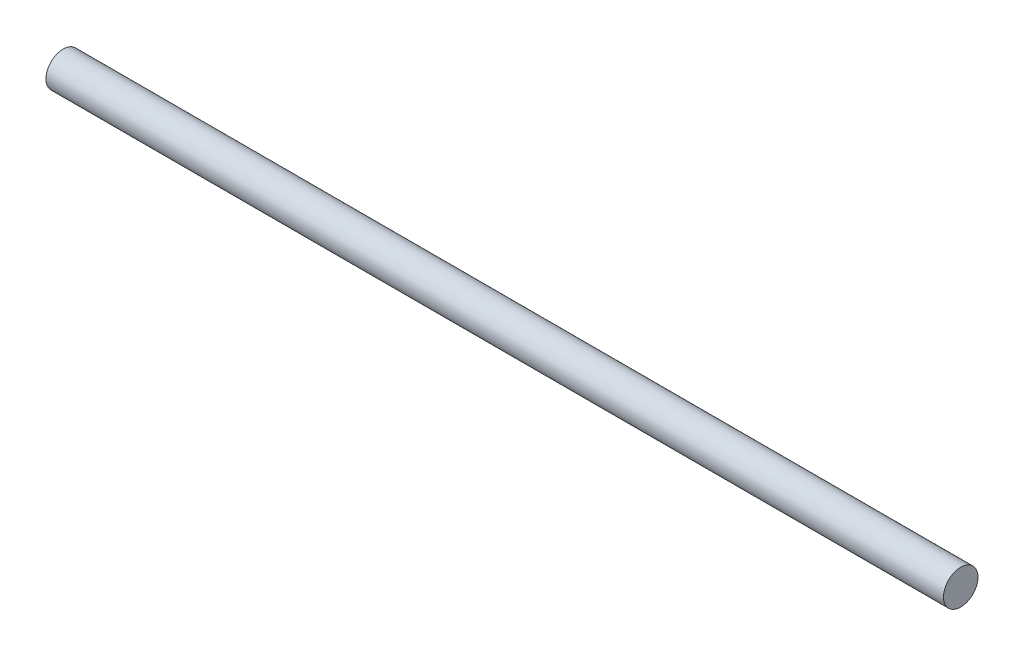
ISO-10303-21;
HEADER;
FILE_DESCRIPTION(('STEP AP214'),'2;1');
FILE_NAME('part.step','',(''),(''),'','','');
FILE_SCHEMA(('AUTOMOTIVE_DESIGN { 1 0 10303 214 1 1 1 1 }'));
ENDSEC;
DATA;
#1=APPLICATION_CONTEXT('core data for automotive mechanical design processes');
#2=APPLICATION_PROTOCOL_DEFINITION('international standard','automotive_design',2000,#1);
#3=PRODUCT_CONTEXT('',#1,'mechanical');
#4=PRODUCT('Part','Part','',(#3));
#5=PRODUCT_RELATED_PRODUCT_CATEGORY('part','',(#4));
#6=PRODUCT_DEFINITION_FORMATION('','',#4);
#7=PRODUCT_DEFINITION_CONTEXT('part definition',#1,'design');
#8=PRODUCT_DEFINITION('design','',#6,#7);
#9=PRODUCT_DEFINITION_SHAPE('','',#8);
#10=(LENGTH_UNIT() NAMED_UNIT(*) SI_UNIT(.MILLI.,.METRE.));
#11=(NAMED_UNIT(*) PLANE_ANGLE_UNIT() SI_UNIT($,.RADIAN.));
#12=(NAMED_UNIT(*) SI_UNIT($,.STERADIAN.) SOLID_ANGLE_UNIT());
#13=UNCERTAINTY_MEASURE_WITH_UNIT(LENGTH_MEASURE(1.E-05),#10,'distance_accuracy_value','');
#14=(GEOMETRIC_REPRESENTATION_CONTEXT(3) GLOBAL_UNCERTAINTY_ASSIGNED_CONTEXT((#13)) GLOBAL_UNIT_ASSIGNED_CONTEXT((#10,
#11,#12)) REPRESENTATION_CONTEXT('',''));
#15=CARTESIAN_POINT('',(0.,0.,0.));
#16=DIRECTION('',(0.,0.,1.));
#17=DIRECTION('',(1.,0.,0.));
#18=AXIS2_PLACEMENT_3D('',#15,#16,#17);
#19=CARTESIAN_POINT('',(330.2,0.,0.));
#20=DIRECTION('',(-1.,0.,0.));
#21=DIRECTION('',(0.,0.,1.));
#22=AXIS2_PLACEMENT_3D('',#19,#20,#21);
#23=CYLINDRICAL_SURFACE('',#22,6.35);
#24=CARTESIAN_POINT('',(330.2,0.,0.));
#25=DIRECTION('',(1.,0.,0.));
#26=DIRECTION('',(0.,0.,-1.));
#27=AXIS2_PLACEMENT_3D('',#24,#25,#26);
#28=CIRCLE('',#27,6.35);
#29=CARTESIAN_POINT('',(330.2,0.,-6.35));
#30=VERTEX_POINT('',#29);
#31=EDGE_CURVE('E10',#30,#30,#28,.T.);
#32=ORIENTED_EDGE('',*,*,#31,.F.);
#33=EDGE_LOOP('',(#32));
#34=FACE_BOUND('',#33,.T.);
#35=CARTESIAN_POINT('',(0.,0.,0.));
#36=DIRECTION('',(1.,0.,0.));
#37=DIRECTION('',(0.,0.,-1.));
#38=AXIS2_PLACEMENT_3D('',#35,#36,#37);
#39=CIRCLE('',#38,6.35);
#40=CARTESIAN_POINT('',(0.,0.,-6.35));
#41=VERTEX_POINT('',#40);
#42=EDGE_CURVE('E33',#41,#41,#39,.T.);
#43=ORIENTED_EDGE('',*,*,#42,.T.);
#44=EDGE_LOOP('',(#43));
#45=FACE_BOUND('',#44,.T.);
#46=ADVANCED_FACE('F30',(#34,#45),#23,.T.);
#47=CARTESIAN_POINT('',(330.2,0.,0.));
#48=DIRECTION('',(1.,0.,0.));
#49=DIRECTION('',(0.,0.,-1.));
#50=AXIS2_PLACEMENT_3D('',#47,#48,#49);
#51=PLANE('',#50);
#52=ORIENTED_EDGE('',*,*,#31,.T.);
#53=EDGE_LOOP('',(#52));
#54=FACE_BOUND('',#53,.T.);
#55=ADVANCED_FACE('F45',(#54),#51,.T.);
#56=CARTESIAN_POINT('',(0.,0.,0.));
#57=DIRECTION('',(1.,0.,0.));
#58=DIRECTION('',(0.,0.,-1.));
#59=AXIS2_PLACEMENT_3D('',#56,#57,#58);
#60=PLANE('',#59);
#61=ORIENTED_EDGE('',*,*,#42,.F.);
#62=EDGE_LOOP('',(#61));
#63=FACE_BOUND('',#62,.T.);
#64=ADVANCED_FACE('F43',(#63),#60,.F.);
#65=CLOSED_SHELL('',(#46,#55,#64));
#66=MANIFOLD_SOLID_BREP('B2',#65);
#67=ADVANCED_BREP_SHAPE_REPRESENTATION('',(#18,#66),#14);
#68=SHAPE_DEFINITION_REPRESENTATION(#9,#67);
ENDSEC;
END-ISO-10303-21;
